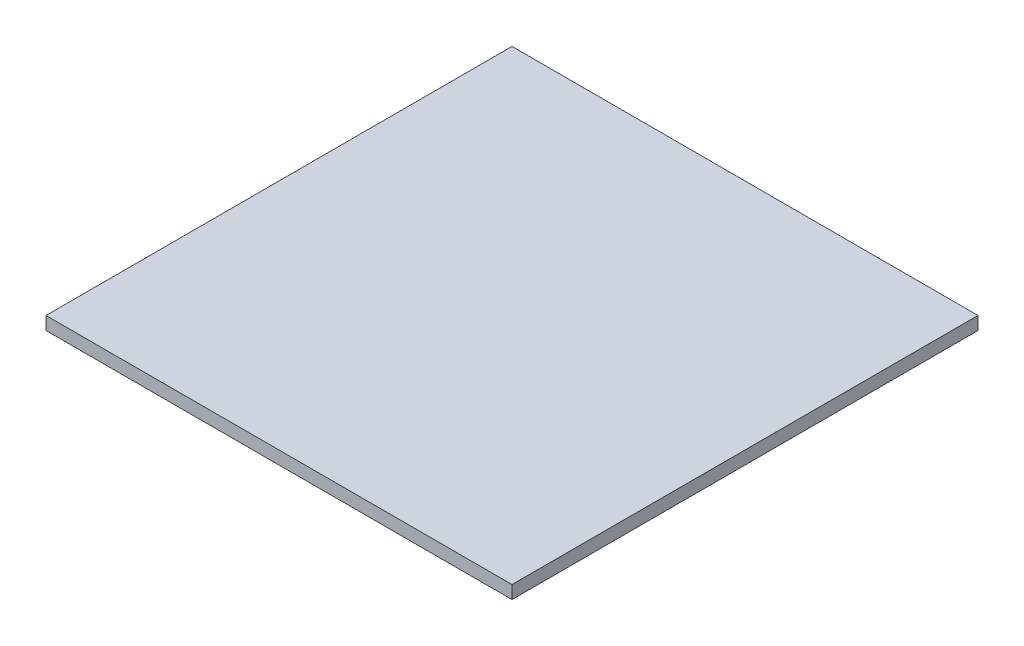
ISO-10303-21;
HEADER;
FILE_DESCRIPTION(('STEP AP214'),'2;1');
FILE_NAME('part.step','',(''),(''),'','','');
FILE_SCHEMA(('AUTOMOTIVE_DESIGN { 1 0 10303 214 1 1 1 1 }'));
ENDSEC;
DATA;
#1=APPLICATION_CONTEXT('core data for automotive mechanical design processes');
#2=APPLICATION_PROTOCOL_DEFINITION('international standard','automotive_design',2000,#1);
#3=PRODUCT_CONTEXT('',#1,'mechanical');
#4=PRODUCT('Part','Part','',(#3));
#5=PRODUCT_RELATED_PRODUCT_CATEGORY('part','',(#4));
#6=PRODUCT_DEFINITION_FORMATION('','',#4);
#7=PRODUCT_DEFINITION_CONTEXT('part definition',#1,'design');
#8=PRODUCT_DEFINITION('design','',#6,#7);
#9=PRODUCT_DEFINITION_SHAPE('','',#8);
#10=(LENGTH_UNIT() NAMED_UNIT(*) SI_UNIT(.MILLI.,.METRE.));
#11=(NAMED_UNIT(*) PLANE_ANGLE_UNIT() SI_UNIT($,.RADIAN.));
#12=(NAMED_UNIT(*) SI_UNIT($,.STERADIAN.) SOLID_ANGLE_UNIT());
#13=UNCERTAINTY_MEASURE_WITH_UNIT(LENGTH_MEASURE(1.E-05),#10,'distance_accuracy_value','');
#14=(GEOMETRIC_REPRESENTATION_CONTEXT(3) GLOBAL_UNCERTAINTY_ASSIGNED_CONTEXT((#13)) GLOBAL_UNIT_ASSIGNED_CONTEXT((#10,
#11,#12)) REPRESENTATION_CONTEXT('',''));
#15=CARTESIAN_POINT('',(0.,0.,0.));
#16=DIRECTION('',(0.,0.,1.));
#17=DIRECTION('',(1.,0.,0.));
#18=AXIS2_PLACEMENT_3D('',#15,#16,#17);
#19=CARTESIAN_POINT('',(12.5,0.35,12.5));
#20=DIRECTION('',(-1.,0.,0.));
#21=DIRECTION('',(0.,0.,1.));
#22=AXIS2_PLACEMENT_3D('',#19,#20,#21);
#23=PLANE('',#22);
#24=DIRECTION('',(0.,0.,-1.));
#25=VECTOR('',#24,1.);
#26=CARTESIAN_POINT('',(12.5,-0.35,12.5));
#27=LINE('',#26,#25);
#28=CARTESIAN_POINT('',(12.5,-0.35,12.5));
#29=VERTEX_POINT('',#28);
#30=CARTESIAN_POINT('',(12.5,-0.35,-12.5));
#31=VERTEX_POINT('',#30);
#32=EDGE_CURVE('E114',#29,#31,#27,.T.);
#33=ORIENTED_EDGE('',*,*,#32,.T.);
#34=DIRECTION('',(0.,-1.,0.));
#35=VECTOR('',#34,1.);
#36=CARTESIAN_POINT('',(12.5,0.35,-12.5));
#37=LINE('',#36,#35);
#38=CARTESIAN_POINT('',(12.5,0.35,-12.5));
#39=VERTEX_POINT('',#38);
#40=EDGE_CURVE('E11',#39,#31,#37,.T.);
#41=ORIENTED_EDGE('',*,*,#40,.F.);
#42=DIRECTION('',(0.,0.,-1.));
#43=VECTOR('',#42,1.);
#44=CARTESIAN_POINT('',(12.5,0.35,12.5));
#45=LINE('',#44,#43);
#46=CARTESIAN_POINT('',(12.5,0.35,12.5));
#47=VERTEX_POINT('',#46);
#48=EDGE_CURVE('E97',#47,#39,#45,.T.);
#49=ORIENTED_EDGE('',*,*,#48,.F.);
#50=DIRECTION('',(0.,-1.,0.));
#51=VECTOR('',#50,1.);
#52=CARTESIAN_POINT('',(12.5,0.35,12.5));
#53=LINE('',#52,#51);
#54=EDGE_CURVE('E110',#47,#29,#53,.T.);
#55=ORIENTED_EDGE('',*,*,#54,.T.);
#56=EDGE_LOOP('',(#33,#41,#49,#55));
#57=FACE_BOUND('',#56,.T.);
#58=ADVANCED_FACE('F40',(#57),#23,.F.);
#59=CARTESIAN_POINT('',(-12.5,0.35,-12.5));
#60=DIRECTION('',(0.,0.,1.));
#61=DIRECTION('',(1.,0.,0.));
#62=AXIS2_PLACEMENT_3D('',#59,#60,#61);
#63=PLANE('',#62);
#64=DIRECTION('',(-1.,0.,0.));
#65=VECTOR('',#64,1.);
#66=CARTESIAN_POINT('',(-12.5,-0.35,-12.5));
#67=LINE('',#66,#65);
#68=CARTESIAN_POINT('',(-12.5,-0.35,-12.5));
#69=VERTEX_POINT('',#68);
#70=EDGE_CURVE('E102',#31,#69,#67,.T.);
#71=ORIENTED_EDGE('',*,*,#70,.T.);
#72=DIRECTION('',(0.,-1.,0.));
#73=VECTOR('',#72,1.);
#74=CARTESIAN_POINT('',(-12.5,0.35,-12.5));
#75=LINE('',#74,#73);
#76=CARTESIAN_POINT('',(-12.5,0.35,-12.5));
#77=VERTEX_POINT('',#76);
#78=EDGE_CURVE('E49',#77,#69,#75,.T.);
#79=ORIENTED_EDGE('',*,*,#78,.F.);
#80=DIRECTION('',(-1.,0.,0.));
#81=VECTOR('',#80,1.);
#82=CARTESIAN_POINT('',(-12.5,0.35,-12.5));
#83=LINE('',#82,#81);
#84=EDGE_CURVE('E92',#39,#77,#83,.T.);
#85=ORIENTED_EDGE('',*,*,#84,.F.);
#86=ORIENTED_EDGE('',*,*,#40,.T.);
#87=EDGE_LOOP('',(#71,#79,#85,#86));
#88=FACE_BOUND('',#87,.T.);
#89=ADVANCED_FACE('F101',(#88),#63,.F.);
#90=CARTESIAN_POINT('',(-12.5,0.35,12.5));
#91=DIRECTION('',(1.,0.,0.));
#92=DIRECTION('',(0.,0.,-1.));
#93=AXIS2_PLACEMENT_3D('',#90,#91,#92);
#94=PLANE('',#93);
#95=DIRECTION('',(0.,0.,1.));
#96=VECTOR('',#95,1.);
#97=CARTESIAN_POINT('',(-12.5,-0.35,12.5));
#98=LINE('',#97,#96);
#99=CARTESIAN_POINT('',(-12.5,-0.35,12.5));
#100=VERTEX_POINT('',#99);
#101=EDGE_CURVE('E79',#69,#100,#98,.T.);
#102=ORIENTED_EDGE('',*,*,#101,.T.);
#103=DIRECTION('',(0.,-1.,0.));
#104=VECTOR('',#103,1.);
#105=CARTESIAN_POINT('',(-12.5,0.35,12.5));
#106=LINE('',#105,#104);
#107=CARTESIAN_POINT('',(-12.5,0.35,12.5));
#108=VERTEX_POINT('',#107);
#109=EDGE_CURVE('E103',#108,#100,#106,.T.);
#110=ORIENTED_EDGE('',*,*,#109,.F.);
#111=DIRECTION('',(0.,0.,1.));
#112=VECTOR('',#111,1.);
#113=CARTESIAN_POINT('',(-12.5,0.35,12.5));
#114=LINE('',#113,#112);
#115=EDGE_CURVE('E95',#77,#108,#114,.T.);
#116=ORIENTED_EDGE('',*,*,#115,.F.);
#117=ORIENTED_EDGE('',*,*,#78,.T.);
#118=EDGE_LOOP('',(#102,#110,#116,#117));
#119=FACE_BOUND('',#118,.T.);
#120=ADVANCED_FACE('F104',(#119),#94,.F.);
#121=CARTESIAN_POINT('',(-12.5,0.35,12.5));
#122=DIRECTION('',(0.,0.,-1.));
#123=DIRECTION('',(-1.,0.,0.));
#124=AXIS2_PLACEMENT_3D('',#121,#122,#123);
#125=PLANE('',#124);
#126=DIRECTION('',(1.,0.,0.));
#127=VECTOR('',#126,1.);
#128=CARTESIAN_POINT('',(-12.5,-0.35,12.5));
#129=LINE('',#128,#127);
#130=EDGE_CURVE('E85',#100,#29,#129,.T.);
#131=ORIENTED_EDGE('',*,*,#130,.T.);
#132=ORIENTED_EDGE('',*,*,#54,.F.);
#133=DIRECTION('',(1.,0.,0.));
#134=VECTOR('',#133,1.);
#135=CARTESIAN_POINT('',(-12.5,0.35,12.5));
#136=LINE('',#135,#134);
#137=EDGE_CURVE('E60',#108,#47,#136,.T.);
#138=ORIENTED_EDGE('',*,*,#137,.F.);
#139=ORIENTED_EDGE('',*,*,#109,.T.);
#140=EDGE_LOOP('',(#131,#132,#138,#139));
#141=FACE_BOUND('',#140,.T.);
#142=ADVANCED_FACE('F125',(#141),#125,.F.);
#143=CARTESIAN_POINT('',(0.,0.35,0.));
#144=DIRECTION('',(0.,-1.,0.));
#145=DIRECTION('',(0.,0.,-1.));
#146=AXIS2_PLACEMENT_3D('',#143,#144,#145);
#147=PLANE('',#146);
#148=ORIENTED_EDGE('',*,*,#48,.T.);
#149=ORIENTED_EDGE('',*,*,#84,.T.);
#150=ORIENTED_EDGE('',*,*,#115,.T.);
#151=ORIENTED_EDGE('',*,*,#137,.T.);
#152=EDGE_LOOP('',(#148,#149,#150,#151));
#153=FACE_BOUND('',#152,.T.);
#154=ADVANCED_FACE('F93',(#153),#147,.F.);
#155=CARTESIAN_POINT('',(0.,-0.35,0.));
#156=DIRECTION('',(0.,-1.,0.));
#157=DIRECTION('',(0.,0.,-1.));
#158=AXIS2_PLACEMENT_3D('',#155,#156,#157);
#159=PLANE('',#158);
#160=ORIENTED_EDGE('',*,*,#32,.F.);
#161=ORIENTED_EDGE('',*,*,#130,.F.);
#162=ORIENTED_EDGE('',*,*,#101,.F.);
#163=ORIENTED_EDGE('',*,*,#70,.F.);
#164=EDGE_LOOP('',(#160,#161,#162,#163));
#165=FACE_BOUND('',#164,.T.);
#166=ADVANCED_FACE('F128',(#165),#159,.T.);
#167=CLOSED_SHELL('',(#58,#89,#120,#142,#154,#166));
#168=MANIFOLD_SOLID_BREP('B2',#167);
#169=ADVANCED_BREP_SHAPE_REPRESENTATION('',(#18,#168),#14);
#170=SHAPE_DEFINITION_REPRESENTATION(#9,#169);
ENDSEC;
END-ISO-10303-21;
